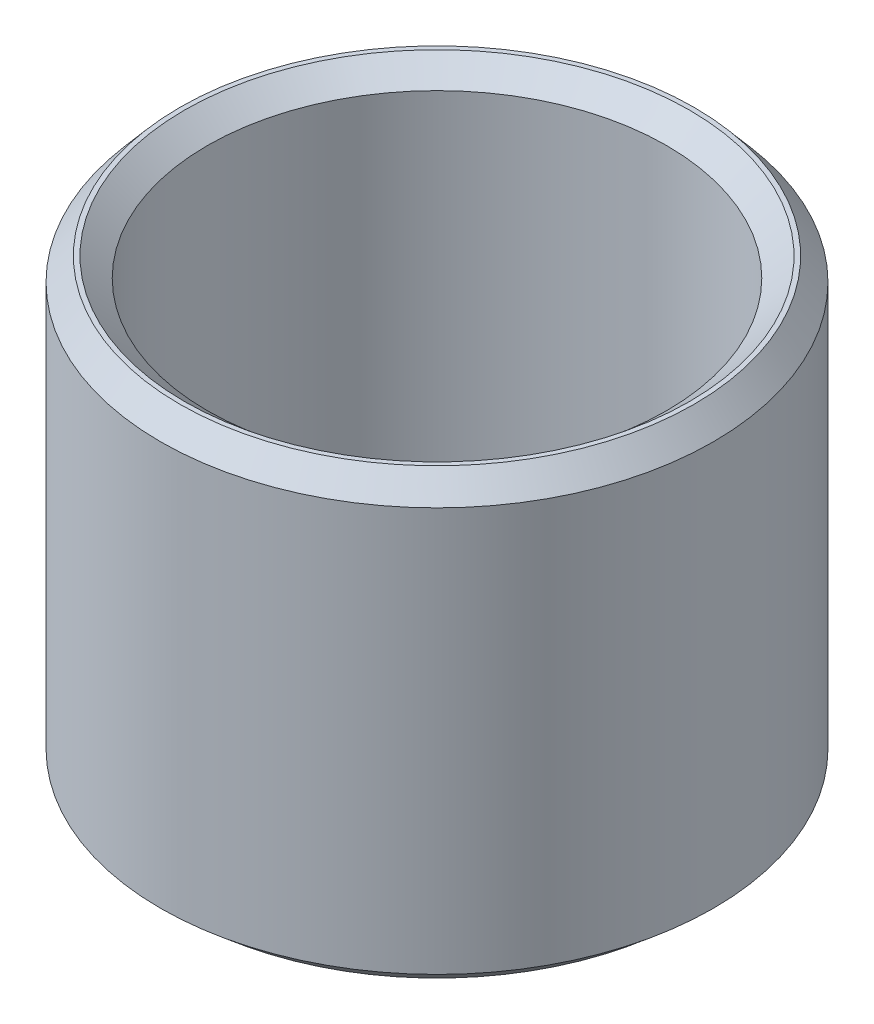
ISO-10303-21;
HEADER;
FILE_DESCRIPTION(('STEP AP214'),'2;1');
FILE_NAME('part.step','',(''),(''),'','','');
FILE_SCHEMA(('AUTOMOTIVE_DESIGN { 1 0 10303 214 1 1 1 1 }'));
ENDSEC;
DATA;
#1=APPLICATION_CONTEXT('core data for automotive mechanical design processes');
#2=APPLICATION_PROTOCOL_DEFINITION('international standard','automotive_design',2000,#1);
#3=PRODUCT_CONTEXT('',#1,'mechanical');
#4=PRODUCT('Part','Part','',(#3));
#5=PRODUCT_RELATED_PRODUCT_CATEGORY('part','',(#4));
#6=PRODUCT_DEFINITION_FORMATION('','',#4);
#7=PRODUCT_DEFINITION_CONTEXT('part definition',#1,'design');
#8=PRODUCT_DEFINITION('design','',#6,#7);
#9=PRODUCT_DEFINITION_SHAPE('','',#8);
#10=(LENGTH_UNIT() NAMED_UNIT(*) SI_UNIT(.MILLI.,.METRE.));
#11=(NAMED_UNIT(*) PLANE_ANGLE_UNIT() SI_UNIT($,.RADIAN.));
#12=(NAMED_UNIT(*) SI_UNIT($,.STERADIAN.) SOLID_ANGLE_UNIT());
#13=UNCERTAINTY_MEASURE_WITH_UNIT(LENGTH_MEASURE(1.E-05),#10,'distance_accuracy_value','');
#14=(GEOMETRIC_REPRESENTATION_CONTEXT(3) GLOBAL_UNCERTAINTY_ASSIGNED_CONTEXT((#13)) GLOBAL_UNIT_ASSIGNED_CONTEXT((#10,
#11,#12)) REPRESENTATION_CONTEXT('',''));
#15=CARTESIAN_POINT('',(0.,0.,0.));
#16=DIRECTION('',(0.,0.,1.));
#17=DIRECTION('',(1.,0.,0.));
#18=AXIS2_PLACEMENT_3D('',#15,#16,#17);
#19=CARTESIAN_POINT('',(0.,68.5882269277395,0.));
#20=DIRECTION('',(0.,-1.,0.));
#21=DIRECTION('',(0.,0.,-1.));
#22=AXIS2_PLACEMENT_3D('',#19,#20,#21);
#23=CYLINDRICAL_SURFACE('',#22,42.5);
#24=CARTESIAN_POINT('',(0.,2.96997261905087,0.));
#25=DIRECTION('',(0.,1.,0.));
#26=DIRECTION('',(0.,0.,1.));
#27=AXIS2_PLACEMENT_3D('',#24,#25,#26);
#28=CIRCLE('',#27,42.5);
#29=CARTESIAN_POINT('',(0.,2.96997261905087,42.5));
#30=VERTEX_POINT('',#29);
#31=EDGE_CURVE('E10',#30,#30,#28,.T.);
#32=ORIENTED_EDGE('',*,*,#31,.T.);
#33=EDGE_LOOP('',(#32));
#34=FACE_BOUND('',#33,.T.);
#35=CARTESIAN_POINT('',(0.,65.0840287319202,0.));
#36=DIRECTION('',(0.,1.,0.));
#37=DIRECTION('',(0.,0.,1.));
#38=AXIS2_PLACEMENT_3D('',#35,#36,#37);
#39=CIRCLE('',#38,42.5);
#40=CARTESIAN_POINT('',(0.,65.0840287319202,42.5));
#41=VERTEX_POINT('',#40);
#42=EDGE_CURVE('E50',#41,#41,#39,.F.);
#43=ORIENTED_EDGE('',*,*,#42,.T.);
#44=EDGE_LOOP('',(#43));
#45=FACE_BOUND('',#44,.T.);
#46=ADVANCED_FACE('F39',(#34,#45),#23,.T.);
#47=CARTESIAN_POINT('',(0.,68.5882269277395,0.));
#48=DIRECTION('',(0.,1.,0.));
#49=DIRECTION('',(0.,0.,1.));
#50=AXIS2_PLACEMENT_3D('',#47,#48,#49);
#51=PLANE('',#50);
#52=CARTESIAN_POINT('',(0.,68.5882269277395,0.));
#53=DIRECTION('',(0.,1.,0.));
#54=DIRECTION('',(0.,0.,1.));
#55=AXIS2_PLACEMENT_3D('',#52,#53,#54);
#56=CIRCLE('',#55,38.8090302187203);
#57=CARTESIAN_POINT('',(0.,68.5882269277395,38.8090302187203));
#58=VERTEX_POINT('',#57);
#59=EDGE_CURVE('E58',#58,#58,#56,.F.);
#60=ORIENTED_EDGE('',*,*,#59,.T.);
#61=EDGE_LOOP('',(#60));
#62=FACE_BOUND('',#61,.T.);
#63=CARTESIAN_POINT('',(0.,68.5882269277395,0.));
#64=DIRECTION('',(0.,1.,0.));
#65=DIRECTION('',(0.,0.,1.));
#66=AXIS2_PLACEMENT_3D('',#63,#64,#65);
#67=CIRCLE('',#66,39.5300273809491);
#68=CARTESIAN_POINT('',(0.,68.5882269277395,39.5300273809491));
#69=VERTEX_POINT('',#68);
#70=EDGE_CURVE('E61',#69,#69,#67,.T.);
#71=ORIENTED_EDGE('',*,*,#70,.T.);
#72=EDGE_LOOP('',(#71));
#73=FACE_BOUND('',#72,.T.);
#74=ADVANCED_FACE('F88',(#62,#73),#51,.T.);
#75=CARTESIAN_POINT('',(0.,0.,0.));
#76=DIRECTION('',(0.,1.,0.));
#77=DIRECTION('',(0.,0.,1.));
#78=AXIS2_PLACEMENT_3D('',#75,#76,#77);
#79=PLANE('',#78);
#80=CARTESIAN_POINT('',(0.,0.,0.));
#81=DIRECTION('',(0.,1.,0.));
#82=DIRECTION('',(0.,0.,1.));
#83=AXIS2_PLACEMENT_3D('',#80,#81,#82);
#84=CIRCLE('',#83,38.2748046419518);
#85=CARTESIAN_POINT('',(0.,0.,38.2748046419518));
#86=VERTEX_POINT('',#85);
#87=EDGE_CURVE('E51',#86,#86,#84,.T.);
#88=ORIENTED_EDGE('',*,*,#87,.T.);
#89=EDGE_LOOP('',(#88));
#90=FACE_BOUND('',#89,.T.);
#91=CARTESIAN_POINT('',(0.,0.,0.));
#92=DIRECTION('',(0.,1.,0.));
#93=DIRECTION('',(0.,0.,1.));
#94=AXIS2_PLACEMENT_3D('',#91,#92,#93);
#95=CIRCLE('',#94,38.9958018041807);
#96=CARTESIAN_POINT('',(0.,0.,38.9958018041807));
#97=VERTEX_POINT('',#96);
#98=EDGE_CURVE('E54',#97,#97,#95,.F.);
#99=ORIENTED_EDGE('',*,*,#98,.T.);
#100=EDGE_LOOP('',(#99));
#101=FACE_BOUND('',#100,.T.);
#102=ADVANCED_FACE('F83',(#90,#101),#79,.F.);
#103=CARTESIAN_POINT('',(0.,68.5882269277395,0.));
#104=DIRECTION('',(0.,-1.,0.));
#105=DIRECTION('',(0.,0.,-1.));
#106=AXIS2_PLACEMENT_3D('',#103,#104,#105);
#107=CYLINDRICAL_SURFACE('',#106,35.304832022901);
#108=CARTESIAN_POINT('',(0.,65.6182543086886,0.));
#109=DIRECTION('',(0.,1.,0.));
#110=DIRECTION('',(0.,0.,1.));
#111=AXIS2_PLACEMENT_3D('',#108,#109,#110);
#112=CIRCLE('',#111,35.304832022901);
#113=CARTESIAN_POINT('',(0.,65.6182543086886,35.304832022901));
#114=VERTEX_POINT('',#113);
#115=EDGE_CURVE('E67',#114,#114,#112,.T.);
#116=ORIENTED_EDGE('',*,*,#115,.T.);
#117=EDGE_LOOP('',(#116));
#118=FACE_BOUND('',#117,.T.);
#119=CARTESIAN_POINT('',(0.,3.50419819581928,0.));
#120=DIRECTION('',(0.,1.,0.));
#121=DIRECTION('',(0.,0.,1.));
#122=AXIS2_PLACEMENT_3D('',#119,#120,#121);
#123=CIRCLE('',#122,35.304832022901);
#124=CARTESIAN_POINT('',(0.,3.50419819581928,35.304832022901));
#125=VERTEX_POINT('',#124);
#126=EDGE_CURVE('E69',#125,#125,#123,.F.);
#127=ORIENTED_EDGE('',*,*,#126,.T.);
#128=EDGE_LOOP('',(#127));
#129=FACE_BOUND('',#128,.T.);
#130=ADVANCED_FACE('F71',(#118,#129),#107,.F.);
#131=CARTESIAN_POINT('',(0.,65.6182543086886,0.));
#132=DIRECTION('',(0.,1.,0.));
#133=DIRECTION('',(0.,0.,1.));
#134=AXIS2_PLACEMENT_3D('',#131,#132,#133);
#135=CONICAL_SURFACE('',#134,35.304832022901,0.867728088572762);
#136=ORIENTED_EDGE('',*,*,#59,.F.);
#137=EDGE_LOOP('',(#136));
#138=FACE_BOUND('',#137,.T.);
#139=ORIENTED_EDGE('',*,*,#115,.F.);
#140=EDGE_LOOP('',(#139));
#141=FACE_BOUND('',#140,.T.);
#142=ADVANCED_FACE('F77',(#138,#141),#135,.F.);
#143=CARTESIAN_POINT('',(0.,0.,0.));
#144=DIRECTION('',(0.,-1.,0.));
#145=DIRECTION('',(0.,0.,-1.));
#146=AXIS2_PLACEMENT_3D('',#143,#144,#145);
#147=CONICAL_SURFACE('',#146,38.2748046419518,0.703068238222132);
#148=ORIENTED_EDGE('',*,*,#126,.F.);
#149=EDGE_LOOP('',(#148));
#150=FACE_BOUND('',#149,.T.);
#151=ORIENTED_EDGE('',*,*,#87,.F.);
#152=EDGE_LOOP('',(#151));
#153=FACE_BOUND('',#152,.T.);
#154=ADVANCED_FACE('F73',(#150,#153),#147,.F.);
#155=CARTESIAN_POINT('',(0.,2.96997261905087,0.));
#156=DIRECTION('',(0.,1.,0.));
#157=DIRECTION('',(0.,0.,1.));
#158=AXIS2_PLACEMENT_3D('',#155,#156,#157);
#159=CONICAL_SURFACE('',#158,42.5,0.867728088572765);
#160=ORIENTED_EDGE('',*,*,#98,.F.);
#161=EDGE_LOOP('',(#160));
#162=FACE_BOUND('',#161,.T.);
#163=ORIENTED_EDGE('',*,*,#31,.F.);
#164=EDGE_LOOP('',(#163));
#165=FACE_BOUND('',#164,.T.);
#166=ADVANCED_FACE('F76',(#162,#165),#159,.T.);
#167=CARTESIAN_POINT('',(0.,68.5882269277395,0.));
#168=DIRECTION('',(0.,-1.,0.));
#169=DIRECTION('',(0.,0.,-1.));
#170=AXIS2_PLACEMENT_3D('',#167,#168,#169);
#171=CONICAL_SURFACE('',#170,39.5300273809491,0.703068238222134);
#172=ORIENTED_EDGE('',*,*,#42,.F.);
#173=EDGE_LOOP('',(#172));
#174=FACE_BOUND('',#173,.T.);
#175=ORIENTED_EDGE('',*,*,#70,.F.);
#176=EDGE_LOOP('',(#175));
#177=FACE_BOUND('',#176,.T.);
#178=ADVANCED_FACE('F45',(#174,#177),#171,.T.);
#179=CLOSED_SHELL('',(#46,#74,#102,#130,#142,#154,#166,#178));
#180=MANIFOLD_SOLID_BREP('B2',#179);
#181=ADVANCED_BREP_SHAPE_REPRESENTATION('',(#18,#180),#14);
#182=SHAPE_DEFINITION_REPRESENTATION(#9,#181);
ENDSEC;
END-ISO-10303-21;
